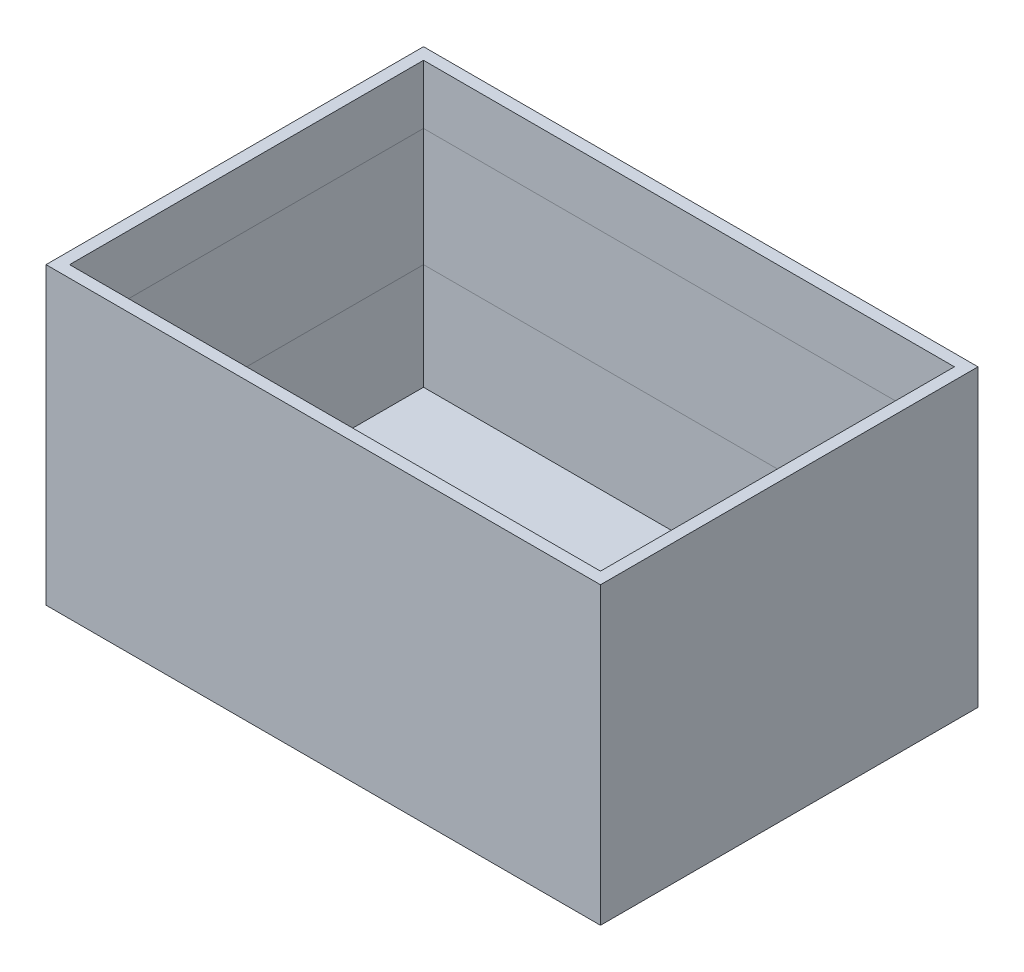
ISO-10303-21;
HEADER;
FILE_DESCRIPTION(('STEP AP214'),'2;1');
FILE_NAME('part.step','',(''),(''),'','','');
FILE_SCHEMA(('AUTOMOTIVE_DESIGN { 1 0 10303 214 1 1 1 1 }'));
ENDSEC;
DATA;
#1=APPLICATION_CONTEXT('core data for automotive mechanical design processes');
#2=APPLICATION_PROTOCOL_DEFINITION('international standard','automotive_design',2000,#1);
#3=PRODUCT_CONTEXT('',#1,'mechanical');
#4=PRODUCT('Part','Part','',(#3));
#5=PRODUCT_RELATED_PRODUCT_CATEGORY('part','',(#4));
#6=PRODUCT_DEFINITION_FORMATION('','',#4);
#7=PRODUCT_DEFINITION_CONTEXT('part definition',#1,'design');
#8=PRODUCT_DEFINITION('design','',#6,#7);
#9=PRODUCT_DEFINITION_SHAPE('','',#8);
#10=(LENGTH_UNIT() NAMED_UNIT(*) SI_UNIT(.MILLI.,.METRE.));
#11=(NAMED_UNIT(*) PLANE_ANGLE_UNIT() SI_UNIT($,.RADIAN.));
#12=(NAMED_UNIT(*) SI_UNIT($,.STERADIAN.) SOLID_ANGLE_UNIT());
#13=UNCERTAINTY_MEASURE_WITH_UNIT(LENGTH_MEASURE(1.E-05),#10,'distance_accuracy_value','');
#14=(GEOMETRIC_REPRESENTATION_CONTEXT(3) GLOBAL_UNCERTAINTY_ASSIGNED_CONTEXT((#13)) GLOBAL_UNIT_ASSIGNED_CONTEXT((#10,
#11,#12)) REPRESENTATION_CONTEXT('',''));
#15=CARTESIAN_POINT('',(0.,0.,0.));
#16=DIRECTION('',(0.,0.,1.));
#17=DIRECTION('',(1.,0.,0.));
#18=AXIS2_PLACEMENT_3D('',#15,#16,#17);
#19=CARTESIAN_POINT('',(-225.,240.,150.));
#20=DIRECTION('',(0.,0.,-1.));
#21=DIRECTION('',(-1.,0.,0.));
#22=AXIS2_PLACEMENT_3D('',#19,#20,#21);
#23=PLANE('',#22);
#24=DIRECTION('',(0.,-1.,0.));
#25=VECTOR('',#24,1.);
#26=CARTESIAN_POINT('',(225.,240.,150.));
#27=LINE('',#26,#25);
#28=CARTESIAN_POINT('',(225.,200.,150.));
#29=VERTEX_POINT('',#28);
#30=CARTESIAN_POINT('',(225.,100.,150.));
#31=VERTEX_POINT('',#30);
#32=EDGE_CURVE('E188',#29,#31,#27,.T.);
#33=ORIENTED_EDGE('',*,*,#32,.T.);
#34=DIRECTION('',(-1.,0.,0.));
#35=VECTOR('',#34,1.);
#36=CARTESIAN_POINT('',(-225.,100.,150.));
#37=LINE('',#36,#35);
#38=CARTESIAN_POINT('',(-225.,100.,150.));
#39=VERTEX_POINT('',#38);
#40=EDGE_CURVE('E11',#31,#39,#37,.T.);
#41=ORIENTED_EDGE('',*,*,#40,.T.);
#42=DIRECTION('',(0.,-1.,0.));
#43=VECTOR('',#42,1.);
#44=CARTESIAN_POINT('',(-225.,240.,150.));
#45=LINE('',#44,#43);
#46=CARTESIAN_POINT('',(-225.,200.,150.));
#47=VERTEX_POINT('',#46);
#48=EDGE_CURVE('E145',#47,#39,#45,.T.);
#49=ORIENTED_EDGE('',*,*,#48,.F.);
#50=DIRECTION('',(1.,0.,0.));
#51=VECTOR('',#50,1.);
#52=CARTESIAN_POINT('',(-225.,200.,150.));
#53=LINE('',#52,#51);
#54=EDGE_CURVE('E54',#47,#29,#53,.T.);
#55=ORIENTED_EDGE('',*,*,#54,.T.);
#56=EDGE_LOOP('',(#33,#41,#49,#55));
#57=FACE_BOUND('',#56,.T.);
#58=ADVANCED_FACE('F44',(#57),#23,.T.);
#59=ORIENTED_EDGE('',*,*,#40,.F.);
#60=CARTESIAN_POINT('',(225.,10.,150.));
#61=VERTEX_POINT('',#60);
#62=EDGE_CURVE('E185',#31,#61,#27,.T.);
#63=ORIENTED_EDGE('',*,*,#62,.T.);
#64=DIRECTION('',(1.,0.,0.));
#65=VECTOR('',#64,1.);
#66=CARTESIAN_POINT('',(-225.,10.,150.));
#67=LINE('',#66,#65);
#68=CARTESIAN_POINT('',(-225.,10.,150.));
#69=VERTEX_POINT('',#68);
#70=EDGE_CURVE('E169',#69,#61,#67,.T.);
#71=ORIENTED_EDGE('',*,*,#70,.F.);
#72=EDGE_CURVE('E147',#39,#69,#45,.T.);
#73=ORIENTED_EDGE('',*,*,#72,.F.);
#74=EDGE_LOOP('',(#59,#63,#71,#73));
#75=FACE_BOUND('',#74,.T.);
#76=ADVANCED_FACE('F260',(#75),#23,.T.);
#77=CARTESIAN_POINT('',(225.,240.,150.));
#78=DIRECTION('',(-1.,0.,0.));
#79=DIRECTION('',(0.,0.,1.));
#80=AXIS2_PLACEMENT_3D('',#77,#78,#79);
#81=PLANE('',#80);
#82=DIRECTION('',(0.,-1.,0.));
#83=VECTOR('',#82,1.);
#84=CARTESIAN_POINT('',(225.,240.,-150.));
#85=LINE('',#84,#83);
#86=CARTESIAN_POINT('',(225.,200.,-150.));
#87=VERTEX_POINT('',#86);
#88=CARTESIAN_POINT('',(225.,100.,-150.));
#89=VERTEX_POINT('',#88);
#90=EDGE_CURVE('E186',#87,#89,#85,.T.);
#91=ORIENTED_EDGE('',*,*,#90,.T.);
#92=DIRECTION('',(0.,0.,1.));
#93=VECTOR('',#92,1.);
#94=CARTESIAN_POINT('',(225.,100.,150.));
#95=LINE('',#94,#93);
#96=EDGE_CURVE('E219',#89,#31,#95,.T.);
#97=ORIENTED_EDGE('',*,*,#96,.T.);
#98=ORIENTED_EDGE('',*,*,#32,.F.);
#99=DIRECTION('',(0.,0.,-1.));
#100=VECTOR('',#99,1.);
#101=CARTESIAN_POINT('',(225.,200.,150.));
#102=LINE('',#101,#100);
#103=EDGE_CURVE('E222',#29,#87,#102,.T.);
#104=ORIENTED_EDGE('',*,*,#103,.T.);
#105=EDGE_LOOP('',(#91,#97,#98,#104));
#106=FACE_BOUND('',#105,.T.);
#107=ADVANCED_FACE('F257',(#106),#81,.T.);
#108=ORIENTED_EDGE('',*,*,#96,.F.);
#109=CARTESIAN_POINT('',(225.,10.,-150.));
#110=VERTEX_POINT('',#109);
#111=EDGE_CURVE('E180',#89,#110,#85,.T.);
#112=ORIENTED_EDGE('',*,*,#111,.T.);
#113=DIRECTION('',(0.,0.,-1.));
#114=VECTOR('',#113,1.);
#115=CARTESIAN_POINT('',(225.,10.,150.));
#116=LINE('',#115,#114);
#117=EDGE_CURVE('E172',#61,#110,#116,.T.);
#118=ORIENTED_EDGE('',*,*,#117,.F.);
#119=ORIENTED_EDGE('',*,*,#62,.F.);
#120=EDGE_LOOP('',(#108,#112,#118,#119));
#121=FACE_BOUND('',#120,.T.);
#122=ADVANCED_FACE('F267',(#121),#81,.T.);
#123=CARTESIAN_POINT('',(-225.,240.,-150.));
#124=DIRECTION('',(0.,0.,1.));
#125=DIRECTION('',(1.,0.,0.));
#126=AXIS2_PLACEMENT_3D('',#123,#124,#125);
#127=PLANE('',#126);
#128=DIRECTION('',(0.,-1.,0.));
#129=VECTOR('',#128,1.);
#130=CARTESIAN_POINT('',(-225.,240.,-150.));
#131=LINE('',#130,#129);
#132=CARTESIAN_POINT('',(-225.,200.,-150.));
#133=VERTEX_POINT('',#132);
#134=CARTESIAN_POINT('',(-225.,100.,-150.));
#135=VERTEX_POINT('',#134);
#136=EDGE_CURVE('E181',#133,#135,#131,.T.);
#137=ORIENTED_EDGE('',*,*,#136,.T.);
#138=DIRECTION('',(1.,0.,0.));
#139=VECTOR('',#138,1.);
#140=CARTESIAN_POINT('',(-225.,100.,-150.));
#141=LINE('',#140,#139);
#142=EDGE_CURVE('E223',#135,#89,#141,.T.);
#143=ORIENTED_EDGE('',*,*,#142,.T.);
#144=ORIENTED_EDGE('',*,*,#90,.F.);
#145=DIRECTION('',(-1.,0.,0.));
#146=VECTOR('',#145,1.);
#147=CARTESIAN_POINT('',(-225.,200.,-150.));
#148=LINE('',#147,#146);
#149=EDGE_CURVE('E227',#87,#133,#148,.T.);
#150=ORIENTED_EDGE('',*,*,#149,.T.);
#151=EDGE_LOOP('',(#137,#143,#144,#150));
#152=FACE_BOUND('',#151,.T.);
#153=ADVANCED_FACE('F242',(#152),#127,.T.);
#154=ORIENTED_EDGE('',*,*,#142,.F.);
#155=CARTESIAN_POINT('',(-225.,10.,-150.));
#156=VERTEX_POINT('',#155);
#157=EDGE_CURVE('E178',#135,#156,#131,.T.);
#158=ORIENTED_EDGE('',*,*,#157,.T.);
#159=DIRECTION('',(-1.,0.,0.));
#160=VECTOR('',#159,1.);
#161=CARTESIAN_POINT('',(-225.,10.,-150.));
#162=LINE('',#161,#160);
#163=EDGE_CURVE('E175',#110,#156,#162,.T.);
#164=ORIENTED_EDGE('',*,*,#163,.F.);
#165=ORIENTED_EDGE('',*,*,#111,.F.);
#166=EDGE_LOOP('',(#154,#158,#164,#165));
#167=FACE_BOUND('',#166,.T.);
#168=ADVANCED_FACE('F270',(#167),#127,.T.);
#169=CARTESIAN_POINT('',(-225.,240.,150.));
#170=DIRECTION('',(1.,0.,0.));
#171=DIRECTION('',(0.,0.,-1.));
#172=AXIS2_PLACEMENT_3D('',#169,#170,#171);
#173=PLANE('',#172);
#174=ORIENTED_EDGE('',*,*,#48,.T.);
#175=DIRECTION('',(0.,0.,-1.));
#176=VECTOR('',#175,1.);
#177=CARTESIAN_POINT('',(-225.,100.,150.));
#178=LINE('',#177,#176);
#179=EDGE_CURVE('E228',#39,#135,#178,.T.);
#180=ORIENTED_EDGE('',*,*,#179,.T.);
#181=ORIENTED_EDGE('',*,*,#136,.F.);
#182=DIRECTION('',(0.,0.,1.));
#183=VECTOR('',#182,1.);
#184=CARTESIAN_POINT('',(-225.,200.,150.));
#185=LINE('',#184,#183);
#186=EDGE_CURVE('E48',#133,#47,#185,.T.);
#187=ORIENTED_EDGE('',*,*,#186,.T.);
#188=EDGE_LOOP('',(#174,#180,#181,#187));
#189=FACE_BOUND('',#188,.T.);
#190=ADVANCED_FACE('F249',(#189),#173,.T.);
#191=ORIENTED_EDGE('',*,*,#179,.F.);
#192=ORIENTED_EDGE('',*,*,#72,.T.);
#193=DIRECTION('',(0.,0.,1.));
#194=VECTOR('',#193,1.);
#195=CARTESIAN_POINT('',(-225.,10.,150.));
#196=LINE('',#195,#194);
#197=EDGE_CURVE('E166',#156,#69,#196,.T.);
#198=ORIENTED_EDGE('',*,*,#197,.F.);
#199=ORIENTED_EDGE('',*,*,#157,.F.);
#200=EDGE_LOOP('',(#191,#192,#198,#199));
#201=FACE_BOUND('',#200,.T.);
#202=ADVANCED_FACE('F272',(#201),#173,.T.);
#203=ORIENTED_EDGE('',*,*,#186,.F.);
#204=CARTESIAN_POINT('',(-225.,250.,-150.));
#205=VERTEX_POINT('',#204);
#206=EDGE_CURVE('E152',#205,#133,#131,.T.);
#207=ORIENTED_EDGE('',*,*,#206,.F.);
#208=DIRECTION('',(0.,0.,-1.));
#209=VECTOR('',#208,1.);
#210=CARTESIAN_POINT('',(-225.,250.,150.));
#211=LINE('',#210,#209);
#212=CARTESIAN_POINT('',(-225.,250.,150.));
#213=VERTEX_POINT('',#212);
#214=EDGE_CURVE('E149',#213,#205,#211,.T.);
#215=ORIENTED_EDGE('',*,*,#214,.F.);
#216=EDGE_CURVE('E134',#213,#47,#45,.T.);
#217=ORIENTED_EDGE('',*,*,#216,.T.);
#218=EDGE_LOOP('',(#203,#207,#215,#217));
#219=FACE_BOUND('',#218,.T.);
#220=ADVANCED_FACE('F150',(#219),#173,.T.);
#221=ORIENTED_EDGE('',*,*,#54,.F.);
#222=ORIENTED_EDGE('',*,*,#216,.F.);
#223=DIRECTION('',(-1.,0.,0.));
#224=VECTOR('',#223,1.);
#225=CARTESIAN_POINT('',(225.,250.,150.));
#226=LINE('',#225,#224);
#227=CARTESIAN_POINT('',(225.,250.,150.));
#228=VERTEX_POINT('',#227);
#229=EDGE_CURVE('E139',#228,#213,#226,.T.);
#230=ORIENTED_EDGE('',*,*,#229,.F.);
#231=EDGE_CURVE('E187',#228,#29,#27,.T.);
#232=ORIENTED_EDGE('',*,*,#231,.T.);
#233=EDGE_LOOP('',(#221,#222,#230,#232));
#234=FACE_BOUND('',#233,.T.);
#235=ADVANCED_FACE('F136',(#234),#23,.T.);
#236=ORIENTED_EDGE('',*,*,#103,.F.);
#237=ORIENTED_EDGE('',*,*,#231,.F.);
#238=DIRECTION('',(0.,0.,1.));
#239=VECTOR('',#238,1.);
#240=CARTESIAN_POINT('',(225.,250.,-150.));
#241=LINE('',#240,#239);
#242=CARTESIAN_POINT('',(225.,250.,-150.));
#243=VERTEX_POINT('',#242);
#244=EDGE_CURVE('E161',#243,#228,#241,.T.);
#245=ORIENTED_EDGE('',*,*,#244,.F.);
#246=EDGE_CURVE('E182',#243,#87,#85,.T.);
#247=ORIENTED_EDGE('',*,*,#246,.T.);
#248=EDGE_LOOP('',(#236,#237,#245,#247));
#249=FACE_BOUND('',#248,.T.);
#250=ADVANCED_FACE('F254',(#249),#81,.T.);
#251=ORIENTED_EDGE('',*,*,#149,.F.);
#252=ORIENTED_EDGE('',*,*,#246,.F.);
#253=DIRECTION('',(1.,0.,0.));
#254=VECTOR('',#253,1.);
#255=CARTESIAN_POINT('',(-225.,250.,-150.));
#256=LINE('',#255,#254);
#257=EDGE_CURVE('E156',#205,#243,#256,.T.);
#258=ORIENTED_EDGE('',*,*,#257,.F.);
#259=ORIENTED_EDGE('',*,*,#206,.T.);
#260=EDGE_LOOP('',(#251,#252,#258,#259));
#261=FACE_BOUND('',#260,.T.);
#262=ADVANCED_FACE('F252',(#261),#127,.T.);
#263=CARTESIAN_POINT('',(0.,10.,0.));
#264=DIRECTION('',(0.,1.,0.));
#265=DIRECTION('',(0.,0.,1.));
#266=AXIS2_PLACEMENT_3D('',#263,#264,#265);
#267=PLANE('',#266);
#268=ORIENTED_EDGE('',*,*,#197,.T.);
#269=ORIENTED_EDGE('',*,*,#70,.T.);
#270=ORIENTED_EDGE('',*,*,#117,.T.);
#271=ORIENTED_EDGE('',*,*,#163,.T.);
#272=EDGE_LOOP('',(#268,#269,#270,#271));
#273=FACE_BOUND('',#272,.T.);
#274=ADVANCED_FACE('F264',(#273),#267,.T.);
#275=CARTESIAN_POINT('',(-235.,250.,0.));
#276=DIRECTION('',(1.,0.,0.));
#277=DIRECTION('',(0.,0.,-1.));
#278=AXIS2_PLACEMENT_3D('',#275,#276,#277);
#279=PLANE('',#278);
#280=DIRECTION('',(0.,0.,1.));
#281=VECTOR('',#280,1.);
#282=CARTESIAN_POINT('',(-235.,0.,0.));
#283=LINE('',#282,#281);
#284=CARTESIAN_POINT('',(-235.,0.,-160.));
#285=VERTEX_POINT('',#284);
#286=CARTESIAN_POINT('',(-235.,0.,160.));
#287=VERTEX_POINT('',#286);
#288=EDGE_CURVE('E144',#285,#287,#283,.T.);
#289=ORIENTED_EDGE('',*,*,#288,.T.);
#290=DIRECTION('',(0.,-1.,0.));
#291=VECTOR('',#290,1.);
#292=CARTESIAN_POINT('',(-235.,250.,160.));
#293=LINE('',#292,#291);
#294=CARTESIAN_POINT('',(-235.,250.,160.));
#295=VERTEX_POINT('',#294);
#296=EDGE_CURVE('E216',#295,#287,#293,.T.);
#297=ORIENTED_EDGE('',*,*,#296,.F.);
#298=DIRECTION('',(0.,0.,1.));
#299=VECTOR('',#298,1.);
#300=CARTESIAN_POINT('',(-235.,250.,0.));
#301=LINE('',#300,#299);
#302=CARTESIAN_POINT('',(-235.,250.,-160.));
#303=VERTEX_POINT('',#302);
#304=EDGE_CURVE('E190',#303,#295,#301,.T.);
#305=ORIENTED_EDGE('',*,*,#304,.F.);
#306=DIRECTION('',(0.,-1.,0.));
#307=VECTOR('',#306,1.);
#308=CARTESIAN_POINT('',(-235.,250.,-160.));
#309=LINE('',#308,#307);
#310=EDGE_CURVE('E200',#303,#285,#309,.T.);
#311=ORIENTED_EDGE('',*,*,#310,.T.);
#312=EDGE_LOOP('',(#289,#297,#305,#311));
#313=FACE_BOUND('',#312,.T.);
#314=ADVANCED_FACE('F46',(#313),#279,.F.);
#315=CARTESIAN_POINT('',(0.,250.,160.));
#316=DIRECTION('',(0.,0.,-1.));
#317=DIRECTION('',(-1.,0.,0.));
#318=AXIS2_PLACEMENT_3D('',#315,#316,#317);
#319=PLANE('',#318);
#320=DIRECTION('',(1.,0.,0.));
#321=VECTOR('',#320,1.);
#322=CARTESIAN_POINT('',(0.,0.,160.));
#323=LINE('',#322,#321);
#324=CARTESIAN_POINT('',(235.,0.,160.));
#325=VERTEX_POINT('',#324);
#326=EDGE_CURVE('E203',#287,#325,#323,.T.);
#327=ORIENTED_EDGE('',*,*,#326,.T.);
#328=DIRECTION('',(0.,-1.,0.));
#329=VECTOR('',#328,1.);
#330=CARTESIAN_POINT('',(235.,250.,160.));
#331=LINE('',#330,#329);
#332=CARTESIAN_POINT('',(235.,250.,160.));
#333=VERTEX_POINT('',#332);
#334=EDGE_CURVE('E213',#333,#325,#331,.T.);
#335=ORIENTED_EDGE('',*,*,#334,.F.);
#336=DIRECTION('',(1.,0.,0.));
#337=VECTOR('',#336,1.);
#338=CARTESIAN_POINT('',(0.,250.,160.));
#339=LINE('',#338,#337);
#340=EDGE_CURVE('E193',#295,#333,#339,.T.);
#341=ORIENTED_EDGE('',*,*,#340,.F.);
#342=ORIENTED_EDGE('',*,*,#296,.T.);
#343=EDGE_LOOP('',(#327,#335,#341,#342));
#344=FACE_BOUND('',#343,.T.);
#345=ADVANCED_FACE('F306',(#344),#319,.F.);
#346=CARTESIAN_POINT('',(235.,250.,0.));
#347=DIRECTION('',(-1.,0.,0.));
#348=DIRECTION('',(0.,0.,1.));
#349=AXIS2_PLACEMENT_3D('',#346,#347,#348);
#350=PLANE('',#349);
#351=DIRECTION('',(0.,0.,-1.));
#352=VECTOR('',#351,1.);
#353=CARTESIAN_POINT('',(235.,0.,0.));
#354=LINE('',#353,#352);
#355=CARTESIAN_POINT('',(235.,0.,-160.));
#356=VERTEX_POINT('',#355);
#357=EDGE_CURVE('E205',#325,#356,#354,.T.);
#358=ORIENTED_EDGE('',*,*,#357,.T.);
#359=DIRECTION('',(0.,-1.,0.));
#360=VECTOR('',#359,1.);
#361=CARTESIAN_POINT('',(235.,250.,-160.));
#362=LINE('',#361,#360);
#363=CARTESIAN_POINT('',(235.,250.,-160.));
#364=VERTEX_POINT('',#363);
#365=EDGE_CURVE('E210',#364,#356,#362,.T.);
#366=ORIENTED_EDGE('',*,*,#365,.F.);
#367=DIRECTION('',(0.,0.,-1.));
#368=VECTOR('',#367,1.);
#369=CARTESIAN_POINT('',(235.,250.,0.));
#370=LINE('',#369,#368);
#371=EDGE_CURVE('E196',#333,#364,#370,.T.);
#372=ORIENTED_EDGE('',*,*,#371,.F.);
#373=ORIENTED_EDGE('',*,*,#334,.T.);
#374=EDGE_LOOP('',(#358,#366,#372,#373));
#375=FACE_BOUND('',#374,.T.);
#376=ADVANCED_FACE('F311',(#375),#350,.F.);
#377=CARTESIAN_POINT('',(0.,250.,-160.));
#378=DIRECTION('',(0.,0.,1.));
#379=DIRECTION('',(1.,0.,0.));
#380=AXIS2_PLACEMENT_3D('',#377,#378,#379);
#381=PLANE('',#380);
#382=DIRECTION('',(-1.,0.,0.));
#383=VECTOR('',#382,1.);
#384=CARTESIAN_POINT('',(0.,0.,-160.));
#385=LINE('',#384,#383);
#386=EDGE_CURVE('E194',#356,#285,#385,.T.);
#387=ORIENTED_EDGE('',*,*,#386,.T.);
#388=ORIENTED_EDGE('',*,*,#310,.F.);
#389=DIRECTION('',(-1.,0.,0.));
#390=VECTOR('',#389,1.);
#391=CARTESIAN_POINT('',(0.,250.,-160.));
#392=LINE('',#391,#390);
#393=EDGE_CURVE('E198',#364,#303,#392,.T.);
#394=ORIENTED_EDGE('',*,*,#393,.F.);
#395=ORIENTED_EDGE('',*,*,#365,.T.);
#396=EDGE_LOOP('',(#387,#388,#394,#395));
#397=FACE_BOUND('',#396,.T.);
#398=ADVANCED_FACE('F326',(#397),#381,.F.);
#399=CARTESIAN_POINT('',(0.,250.,0.));
#400=DIRECTION('',(0.,1.,0.));
#401=DIRECTION('',(0.,0.,1.));
#402=AXIS2_PLACEMENT_3D('',#399,#400,#401);
#403=PLANE('',#402);
#404=ORIENTED_EDGE('',*,*,#229,.T.);
#405=ORIENTED_EDGE('',*,*,#214,.T.);
#406=ORIENTED_EDGE('',*,*,#257,.T.);
#407=ORIENTED_EDGE('',*,*,#244,.T.);
#408=EDGE_LOOP('',(#404,#405,#406,#407));
#409=FACE_BOUND('',#408,.T.);
#410=ORIENTED_EDGE('',*,*,#304,.T.);
#411=ORIENTED_EDGE('',*,*,#340,.T.);
#412=ORIENTED_EDGE('',*,*,#371,.T.);
#413=ORIENTED_EDGE('',*,*,#393,.T.);
#414=EDGE_LOOP('',(#410,#411,#412,#413));
#415=FACE_BOUND('',#414,.T.);
#416=ADVANCED_FACE('F158',(#409,#415),#403,.T.);
#417=CARTESIAN_POINT('',(0.,0.,0.));
#418=DIRECTION('',(0.,1.,0.));
#419=DIRECTION('',(0.,0.,1.));
#420=AXIS2_PLACEMENT_3D('',#417,#418,#419);
#421=PLANE('',#420);
#422=ORIENTED_EDGE('',*,*,#288,.F.);
#423=ORIENTED_EDGE('',*,*,#386,.F.);
#424=ORIENTED_EDGE('',*,*,#357,.F.);
#425=ORIENTED_EDGE('',*,*,#326,.F.);
#426=EDGE_LOOP('',(#422,#423,#424,#425));
#427=FACE_BOUND('',#426,.T.);
#428=ADVANCED_FACE('F319',(#427),#421,.F.);
#429=CLOSED_SHELL('',(#58,#76,#107,#122,#153,#168,#190,#202,#220,#235,#250,#262,#274,#314,#345,
#376,#398,#416,#428));
#430=MANIFOLD_SOLID_BREP('B2',#429);
#431=ADVANCED_BREP_SHAPE_REPRESENTATION('',(#18,#430),#14);
#432=SHAPE_DEFINITION_REPRESENTATION(#9,#431);
ENDSEC;
END-ISO-10303-21;
